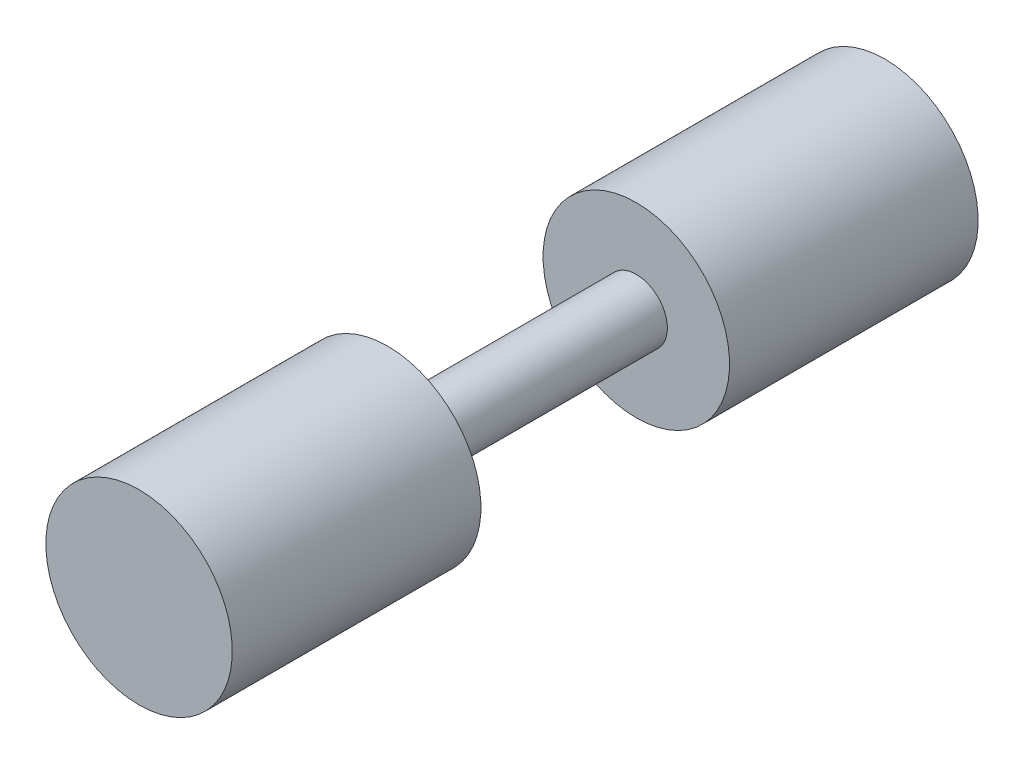
ISO-10303-21;
HEADER;
FILE_DESCRIPTION(('STEP AP214'),'2;1');
FILE_NAME('part.step','',(''),(''),'','','');
FILE_SCHEMA(('AUTOMOTIVE_DESIGN { 1 0 10303 214 1 1 1 1 }'));
ENDSEC;
DATA;
#1=APPLICATION_CONTEXT('core data for automotive mechanical design processes');
#2=APPLICATION_PROTOCOL_DEFINITION('international standard','automotive_design',2000,#1);
#3=PRODUCT_CONTEXT('',#1,'mechanical');
#4=PRODUCT('Part','Part','',(#3));
#5=PRODUCT_RELATED_PRODUCT_CATEGORY('part','',(#4));
#6=PRODUCT_DEFINITION_FORMATION('','',#4);
#7=PRODUCT_DEFINITION_CONTEXT('part definition',#1,'design');
#8=PRODUCT_DEFINITION('design','',#6,#7);
#9=PRODUCT_DEFINITION_SHAPE('','',#8);
#10=(LENGTH_UNIT() NAMED_UNIT(*) SI_UNIT(.MILLI.,.METRE.));
#11=(NAMED_UNIT(*) PLANE_ANGLE_UNIT() SI_UNIT($,.RADIAN.));
#12=(NAMED_UNIT(*) SI_UNIT($,.STERADIAN.) SOLID_ANGLE_UNIT());
#13=UNCERTAINTY_MEASURE_WITH_UNIT(LENGTH_MEASURE(1.E-05),#10,'distance_accuracy_value','');
#14=(GEOMETRIC_REPRESENTATION_CONTEXT(3) GLOBAL_UNCERTAINTY_ASSIGNED_CONTEXT((#13)) GLOBAL_UNIT_ASSIGNED_CONTEXT((#10,
#11,#12)) REPRESENTATION_CONTEXT('',''));
#15=CARTESIAN_POINT('',(0.,0.,0.));
#16=DIRECTION('',(0.,0.,1.));
#17=DIRECTION('',(1.,0.,0.));
#18=AXIS2_PLACEMENT_3D('',#15,#16,#17);
#19=CARTESIAN_POINT('',(0.,0.,-76.2));
#20=DIRECTION('',(0.,0.,-1.));
#21=DIRECTION('',(0.,1.,0.));
#22=AXIS2_PLACEMENT_3D('',#19,#20,#21);
#23=CYLINDRICAL_SURFACE('',#22,19.05);
#24=CARTESIAN_POINT('',(0.,0.,-25.4));
#25=DIRECTION('',(0.,0.,-1.));
#26=DIRECTION('',(0.,1.,0.));
#27=AXIS2_PLACEMENT_3D('',#24,#25,#26);
#28=CIRCLE('',#27,19.05);
#29=CARTESIAN_POINT('',(0.,19.05,-25.4));
#30=VERTEX_POINT('',#29);
#31=EDGE_CURVE('E53',#30,#30,#28,.T.);
#32=ORIENTED_EDGE('',*,*,#31,.T.);
#33=EDGE_LOOP('',(#32));
#34=FACE_BOUND('',#33,.T.);
#35=CARTESIAN_POINT('',(0.,0.,-76.2));
#36=DIRECTION('',(0.,0.,-1.));
#37=DIRECTION('',(0.,1.,0.));
#38=AXIS2_PLACEMENT_3D('',#35,#36,#37);
#39=CIRCLE('',#38,19.05);
#40=CARTESIAN_POINT('',(0.,19.05,-76.2));
#41=VERTEX_POINT('',#40);
#42=EDGE_CURVE('E10',#41,#41,#39,.T.);
#43=ORIENTED_EDGE('',*,*,#42,.F.);
#44=EDGE_LOOP('',(#43));
#45=FACE_BOUND('',#44,.T.);
#46=ADVANCED_FACE('F31',(#34,#45),#23,.T.);
#47=CARTESIAN_POINT('',(0.,19.05,-76.2));
#48=DIRECTION('',(0.,0.,-1.));
#49=DIRECTION('',(0.,1.,0.));
#50=AXIS2_PLACEMENT_3D('',#47,#48,#49);
#51=PLANE('',#50);
#52=ORIENTED_EDGE('',*,*,#42,.T.);
#53=EDGE_LOOP('',(#52));
#54=FACE_BOUND('',#53,.T.);
#55=ADVANCED_FACE('F71',(#54),#51,.T.);
#56=CARTESIAN_POINT('',(0.,0.,76.2));
#57=DIRECTION('',(0.,0.,1.));
#58=DIRECTION('',(0.,-1.,0.));
#59=AXIS2_PLACEMENT_3D('',#56,#57,#58);
#60=PLANE('',#59);
#61=CARTESIAN_POINT('',(0.,0.,76.2));
#62=DIRECTION('',(0.,0.,-1.));
#63=DIRECTION('',(0.,1.,0.));
#64=AXIS2_PLACEMENT_3D('',#61,#62,#63);
#65=CIRCLE('',#64,19.05);
#66=CARTESIAN_POINT('',(0.,19.05,76.2));
#67=VERTEX_POINT('',#66);
#68=EDGE_CURVE('E37',#67,#67,#65,.T.);
#69=ORIENTED_EDGE('',*,*,#68,.F.);
#70=EDGE_LOOP('',(#69));
#71=FACE_BOUND('',#70,.T.);
#72=ADVANCED_FACE('F75',(#71),#60,.T.);
#73=CARTESIAN_POINT('',(0.,0.,-76.2));
#74=DIRECTION('',(0.,0.,-1.));
#75=DIRECTION('',(0.,1.,0.));
#76=AXIS2_PLACEMENT_3D('',#73,#74,#75);
#77=CYLINDRICAL_SURFACE('',#76,19.05);
#78=ORIENTED_EDGE('',*,*,#68,.T.);
#79=EDGE_LOOP('',(#78));
#80=FACE_BOUND('',#79,.T.);
#81=CARTESIAN_POINT('',(0.,0.,25.4));
#82=DIRECTION('',(0.,0.,-1.));
#83=DIRECTION('',(0.,1.,0.));
#84=AXIS2_PLACEMENT_3D('',#81,#82,#83);
#85=CIRCLE('',#84,19.05);
#86=CARTESIAN_POINT('',(0.,19.05,25.4));
#87=VERTEX_POINT('',#86);
#88=EDGE_CURVE('E41',#87,#87,#85,.T.);
#89=ORIENTED_EDGE('',*,*,#88,.F.);
#90=EDGE_LOOP('',(#89));
#91=FACE_BOUND('',#90,.T.);
#92=ADVANCED_FACE('F79',(#80,#91),#77,.T.);
#93=CARTESIAN_POINT('',(0.,19.05,25.4));
#94=DIRECTION('',(0.,0.,-1.));
#95=DIRECTION('',(0.,1.,0.));
#96=AXIS2_PLACEMENT_3D('',#93,#94,#95);
#97=PLANE('',#96);
#98=ORIENTED_EDGE('',*,*,#88,.T.);
#99=EDGE_LOOP('',(#98));
#100=FACE_BOUND('',#99,.T.);
#101=CARTESIAN_POINT('',(0.,0.,25.4));
#102=DIRECTION('',(0.,0.,-1.));
#103=DIRECTION('',(0.,1.,0.));
#104=AXIS2_PLACEMENT_3D('',#101,#102,#103);
#105=CIRCLE('',#104,6.35);
#106=CARTESIAN_POINT('',(0.,6.34999999999998,25.4));
#107=VERTEX_POINT('',#106);
#108=EDGE_CURVE('E45',#107,#107,#105,.T.);
#109=ORIENTED_EDGE('',*,*,#108,.F.);
#110=EDGE_LOOP('',(#109));
#111=FACE_BOUND('',#110,.T.);
#112=ADVANCED_FACE('F67',(#100,#111),#97,.T.);
#113=CARTESIAN_POINT('',(0.,0.,-76.2));
#114=DIRECTION('',(0.,0.,-1.));
#115=DIRECTION('',(0.,1.,0.));
#116=AXIS2_PLACEMENT_3D('',#113,#114,#115);
#117=CYLINDRICAL_SURFACE('',#116,6.35);
#118=ORIENTED_EDGE('',*,*,#108,.T.);
#119=EDGE_LOOP('',(#118));
#120=FACE_BOUND('',#119,.T.);
#121=CARTESIAN_POINT('',(0.,0.,-25.4));
#122=DIRECTION('',(0.,0.,-1.));
#123=DIRECTION('',(0.,1.,0.));
#124=AXIS2_PLACEMENT_3D('',#121,#122,#123);
#125=CIRCLE('',#124,6.35);
#126=CARTESIAN_POINT('',(0.,6.34999999999999,-25.4));
#127=VERTEX_POINT('',#126);
#128=EDGE_CURVE('E50',#127,#127,#125,.T.);
#129=ORIENTED_EDGE('',*,*,#128,.F.);
#130=EDGE_LOOP('',(#129));
#131=FACE_BOUND('',#130,.T.);
#132=ADVANCED_FACE('F61',(#120,#131),#117,.T.);
#133=CARTESIAN_POINT('',(0.,6.34999999999999,-25.4));
#134=DIRECTION('',(0.,0.,1.));
#135=DIRECTION('',(0.,-1.,0.));
#136=AXIS2_PLACEMENT_3D('',#133,#134,#135);
#137=PLANE('',#136);
#138=ORIENTED_EDGE('',*,*,#128,.T.);
#139=EDGE_LOOP('',(#138));
#140=FACE_BOUND('',#139,.T.);
#141=ORIENTED_EDGE('',*,*,#31,.F.);
#142=EDGE_LOOP('',(#141));
#143=FACE_BOUND('',#142,.T.);
#144=ADVANCED_FACE('F59',(#140,#143),#137,.T.);
#145=CLOSED_SHELL('',(#46,#55,#72,#92,#112,#132,#144));
#146=MANIFOLD_SOLID_BREP('B2',#145);
#147=ADVANCED_BREP_SHAPE_REPRESENTATION('',(#18,#146),#14);
#148=SHAPE_DEFINITION_REPRESENTATION(#9,#147);
ENDSEC;
END-ISO-10303-21;
